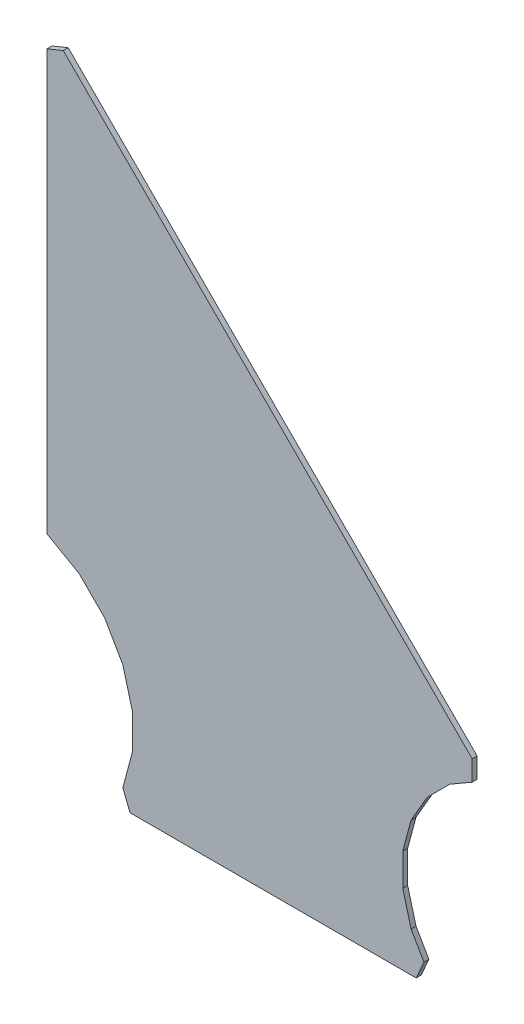
ISO-10303-21;
HEADER;
FILE_DESCRIPTION(('STEP AP214'),'2;1');
FILE_NAME('part.step','',(''),(''),'','','');
FILE_SCHEMA(('AUTOMOTIVE_DESIGN { 1 0 10303 214 1 1 1 1 }'));
ENDSEC;
DATA;
#1=APPLICATION_CONTEXT('core data for automotive mechanical design processes');
#2=APPLICATION_PROTOCOL_DEFINITION('international standard','automotive_design',2000,#1);
#3=PRODUCT_CONTEXT('',#1,'mechanical');
#4=PRODUCT('Part','Part','',(#3));
#5=PRODUCT_RELATED_PRODUCT_CATEGORY('part','',(#4));
#6=PRODUCT_DEFINITION_FORMATION('','',#4);
#7=PRODUCT_DEFINITION_CONTEXT('part definition',#1,'design');
#8=PRODUCT_DEFINITION('design','',#6,#7);
#9=PRODUCT_DEFINITION_SHAPE('','',#8);
#10=(LENGTH_UNIT() NAMED_UNIT(*) SI_UNIT(.MILLI.,.METRE.));
#11=(NAMED_UNIT(*) PLANE_ANGLE_UNIT() SI_UNIT($,.RADIAN.));
#12=(NAMED_UNIT(*) SI_UNIT($,.STERADIAN.) SOLID_ANGLE_UNIT());
#13=UNCERTAINTY_MEASURE_WITH_UNIT(LENGTH_MEASURE(1.E-05),#10,'distance_accuracy_value','');
#14=(GEOMETRIC_REPRESENTATION_CONTEXT(3) GLOBAL_UNCERTAINTY_ASSIGNED_CONTEXT((#13)) GLOBAL_UNIT_ASSIGNED_CONTEXT((#10,
#11,#12)) REPRESENTATION_CONTEXT('',''));
#15=CARTESIAN_POINT('',(0.,0.,0.));
#16=DIRECTION('',(0.,0.,1.));
#17=DIRECTION('',(1.,0.,0.));
#18=AXIS2_PLACEMENT_3D('',#15,#16,#17);
#19=CARTESIAN_POINT('',(89.3880004882813,96.5800018310547,0.));
#20=DIRECTION('',(0.38351701467332,-0.923533810672931,0.));
#21=DIRECTION('',(-0.923533810672931,-0.38351701467332,0.));
#22=AXIS2_PLACEMENT_3D('',#19,#20,#21);
#23=PLANE('',#22);
#24=DIRECTION('',(-0.923533810672931,-0.38351701467332,0.));
#25=VECTOR('',#24,1.);
#26=CARTESIAN_POINT('',(89.3880004882812,96.5800018310547,0.03556));
#27=LINE('',#26,#25);
#28=CARTESIAN_POINT('',(89.3880004882812,96.5800018310547,0.03556));
#29=VERTEX_POINT('',#28);
#30=CARTESIAN_POINT('',(89.2699966430664,96.5309982299805,0.03556));
#31=VERTEX_POINT('',#30);
#32=EDGE_CURVE('E11',#29,#31,#27,.T.);
#33=ORIENTED_EDGE('',*,*,#32,.F.);
#34=DIRECTION('',(0.,0.,1.));
#35=VECTOR('',#34,1.);
#36=CARTESIAN_POINT('',(89.3880004882812,96.5800018310547,0.));
#37=LINE('',#36,#35);
#38=CARTESIAN_POINT('',(89.3880004882812,96.5800018310547,0.));
#39=VERTEX_POINT('',#38);
#40=EDGE_CURVE('E24',#39,#29,#37,.T.);
#41=ORIENTED_EDGE('',*,*,#40,.F.);
#42=DIRECTION('',(-0.923533810672931,-0.38351701467332,0.));
#43=VECTOR('',#42,1.);
#44=CARTESIAN_POINT('',(89.3880004882812,96.5800018310547,0.));
#45=LINE('',#44,#43);
#46=CARTESIAN_POINT('',(89.2699966430664,96.5309982299805,0.));
#47=VERTEX_POINT('',#46);
#48=EDGE_CURVE('E172',#39,#47,#45,.T.);
#49=ORIENTED_EDGE('',*,*,#48,.T.);
#50=DIRECTION('',(0.,0.,1.));
#51=VECTOR('',#50,1.);
#52=CARTESIAN_POINT('',(89.2699966430664,96.5309982299805,0.));
#53=LINE('',#52,#51);
#54=EDGE_CURVE('E37',#47,#31,#53,.T.);
#55=ORIENTED_EDGE('',*,*,#54,.T.);
#56=EDGE_LOOP('',(#33,#41,#49,#55));
#57=FACE_BOUND('',#56,.T.);
#58=ADVANCED_FACE('F17',(#57),#23,.F.);
#59=CARTESIAN_POINT('',(89.2699966430664,96.5309982299805,0.));
#60=DIRECTION('',(1.,0.,0.));
#61=DIRECTION('',(0.,-1.,0.));
#62=AXIS2_PLACEMENT_3D('',#59,#60,#61);
#63=PLANE('',#62);
#64=DIRECTION('',(0.,-1.,0.));
#65=VECTOR('',#64,1.);
#66=CARTESIAN_POINT('',(89.2699966430664,96.5309982299805,0.03556));
#67=LINE('',#66,#65);
#68=CARTESIAN_POINT('',(89.2699966430664,93.5019989013672,0.03556));
#69=VERTEX_POINT('',#68);
#70=EDGE_CURVE('E308',#31,#69,#67,.T.);
#71=ORIENTED_EDGE('',*,*,#70,.F.);
#72=ORIENTED_EDGE('',*,*,#54,.F.);
#73=DIRECTION('',(0.,-1.,0.));
#74=VECTOR('',#73,1.);
#75=CARTESIAN_POINT('',(89.2699966430664,96.5309982299805,0.));
#76=LINE('',#75,#74);
#77=CARTESIAN_POINT('',(89.2699966430664,93.5019989013672,0.));
#78=VERTEX_POINT('',#77);
#79=EDGE_CURVE('E305',#47,#78,#76,.T.);
#80=ORIENTED_EDGE('',*,*,#79,.T.);
#81=DIRECTION('',(0.,0.,1.));
#82=VECTOR('',#81,1.);
#83=CARTESIAN_POINT('',(89.2699966430664,93.5019989013672,0.));
#84=LINE('',#83,#82);
#85=EDGE_CURVE('E303',#78,#69,#84,.T.);
#86=ORIENTED_EDGE('',*,*,#85,.T.);
#87=EDGE_LOOP('',(#71,#72,#80,#86));
#88=FACE_BOUND('',#87,.T.);
#89=ADVANCED_FACE('F316',(#88),#63,.F.);
#90=CARTESIAN_POINT('',(89.2699966430664,93.5019989013672,0.));
#91=DIRECTION('',(0.494509729957547,0.869172092843134,0.));
#92=DIRECTION('',(0.869172092843134,-0.494509729957547,0.));
#93=AXIS2_PLACEMENT_3D('',#90,#91,#92);
#94=PLANE('',#93);
#95=DIRECTION('',(0.869172092843134,-0.494509729957547,0.));
#96=VECTOR('',#95,1.);
#97=CARTESIAN_POINT('',(89.2699966430664,93.5019989013672,0.03556));
#98=LINE('',#97,#96);
#99=CARTESIAN_POINT('',(89.5019989013672,93.370002746582,0.03556));
#100=VERTEX_POINT('',#99);
#101=EDGE_CURVE('E300',#69,#100,#98,.T.);
#102=ORIENTED_EDGE('',*,*,#101,.F.);
#103=ORIENTED_EDGE('',*,*,#85,.F.);
#104=DIRECTION('',(0.869172092843134,-0.494509729957547,0.));
#105=VECTOR('',#104,1.);
#106=CARTESIAN_POINT('',(89.2699966430664,93.5019989013672,0.));
#107=LINE('',#106,#105);
#108=CARTESIAN_POINT('',(89.5019989013672,93.370002746582,0.));
#109=VERTEX_POINT('',#108);
#110=EDGE_CURVE('E297',#78,#109,#107,.T.);
#111=ORIENTED_EDGE('',*,*,#110,.T.);
#112=DIRECTION('',(0.,0.,1.));
#113=VECTOR('',#112,1.);
#114=CARTESIAN_POINT('',(89.5019989013672,93.370002746582,0.));
#115=LINE('',#114,#113);
#116=EDGE_CURVE('E295',#109,#100,#115,.T.);
#117=ORIENTED_EDGE('',*,*,#116,.T.);
#118=EDGE_LOOP('',(#102,#103,#111,#117));
#119=FACE_BOUND('',#118,.T.);
#120=ADVANCED_FACE('F322',(#119),#94,.F.);
#121=CARTESIAN_POINT('',(89.5019989013672,93.370002746582,0.));
#122=DIRECTION('',(0.707121361459365,0.707092200613084,0.));
#123=DIRECTION('',(0.707092200613084,-0.707121361459365,0.));
#124=AXIS2_PLACEMENT_3D('',#121,#122,#123);
#125=PLANE('',#124);
#126=DIRECTION('',(0.707092200613084,-0.707121361459365,0.));
#127=VECTOR('',#126,1.);
#128=CARTESIAN_POINT('',(89.5019989013672,93.370002746582,0.03556));
#129=LINE('',#128,#127);
#130=CARTESIAN_POINT('',(89.6869964599609,93.1849975585938,0.03556));
#131=VERTEX_POINT('',#130);
#132=EDGE_CURVE('E292',#100,#131,#129,.T.);
#133=ORIENTED_EDGE('',*,*,#132,.F.);
#134=ORIENTED_EDGE('',*,*,#116,.F.);
#135=DIRECTION('',(0.707092200613084,-0.707121361459365,0.));
#136=VECTOR('',#135,1.);
#137=CARTESIAN_POINT('',(89.5019989013672,93.370002746582,0.));
#138=LINE('',#137,#136);
#139=CARTESIAN_POINT('',(89.6869964599609,93.1849975585938,0.));
#140=VERTEX_POINT('',#139);
#141=EDGE_CURVE('E289',#109,#140,#138,.T.);
#142=ORIENTED_EDGE('',*,*,#141,.T.);
#143=DIRECTION('',(0.,0.,1.));
#144=VECTOR('',#143,1.);
#145=CARTESIAN_POINT('',(89.6869964599609,93.1849975585938,0.));
#146=LINE('',#145,#144);
#147=EDGE_CURVE('E287',#140,#131,#146,.T.);
#148=ORIENTED_EDGE('',*,*,#147,.T.);
#149=EDGE_LOOP('',(#133,#134,#142,#148));
#150=FACE_BOUND('',#149,.T.);
#151=ADVANCED_FACE('F324',(#150),#125,.F.);
#152=CARTESIAN_POINT('',(89.6869964599609,93.1849975585938,0.));
#153=DIRECTION('',(0.866112397687365,0.4998492918593,0.));
#154=DIRECTION('',(0.4998492918593,-0.866112397687365,0.));
#155=AXIS2_PLACEMENT_3D('',#152,#153,#154);
#156=PLANE('',#155);
#157=DIRECTION('',(0.4998492918593,-0.866112397687365,0.));
#158=VECTOR('',#157,1.);
#159=CARTESIAN_POINT('',(89.6869964599609,93.1849975585938,0.03556));
#160=LINE('',#159,#158);
#161=CARTESIAN_POINT('',(89.818000793457,92.9580001831055,0.03556));
#162=VERTEX_POINT('',#161);
#163=EDGE_CURVE('E284',#131,#162,#160,.T.);
#164=ORIENTED_EDGE('',*,*,#163,.F.);
#165=ORIENTED_EDGE('',*,*,#147,.F.);
#166=DIRECTION('',(0.4998492918593,-0.866112397687365,0.));
#167=VECTOR('',#166,1.);
#168=CARTESIAN_POINT('',(89.6869964599609,93.1849975585938,0.));
#169=LINE('',#168,#167);
#170=CARTESIAN_POINT('',(89.818000793457,92.9580001831055,0.));
#171=VERTEX_POINT('',#170);
#172=EDGE_CURVE('E281',#140,#171,#169,.T.);
#173=ORIENTED_EDGE('',*,*,#172,.T.);
#174=DIRECTION('',(0.,0.,1.));
#175=VECTOR('',#174,1.);
#176=CARTESIAN_POINT('',(89.818000793457,92.9580001831055,0.));
#177=LINE('',#176,#175);
#178=EDGE_CURVE('E279',#171,#162,#177,.T.);
#179=ORIENTED_EDGE('',*,*,#178,.T.);
#180=EDGE_LOOP('',(#164,#165,#173,#179));
#181=FACE_BOUND('',#180,.T.);
#182=ADVANCED_FACE('F329',(#181),#156,.F.);
#183=CARTESIAN_POINT('',(89.818000793457,92.9580001831055,0.));
#184=DIRECTION('',(0.965725052450136,0.259567184116524,0.));
#185=DIRECTION('',(0.259567184116524,-0.965725052450136,0.));
#186=AXIS2_PLACEMENT_3D('',#183,#184,#185);
#187=PLANE('',#186);
#188=DIRECTION('',(0.259567184116524,-0.965725052450136,0.));
#189=VECTOR('',#188,1.);
#190=CARTESIAN_POINT('',(89.818000793457,92.9580001831055,0.03556));
#191=LINE('',#190,#189);
#192=CARTESIAN_POINT('',(89.8860015869141,92.7050018310547,0.03556));
#193=VERTEX_POINT('',#192);
#194=EDGE_CURVE('E276',#162,#193,#191,.T.);
#195=ORIENTED_EDGE('',*,*,#194,.F.);
#196=ORIENTED_EDGE('',*,*,#178,.F.);
#197=DIRECTION('',(0.259567184116524,-0.965725052450136,0.));
#198=VECTOR('',#197,1.);
#199=CARTESIAN_POINT('',(89.818000793457,92.9580001831055,0.));
#200=LINE('',#199,#198);
#201=CARTESIAN_POINT('',(89.8860015869141,92.7050018310547,0.));
#202=VERTEX_POINT('',#201);
#203=EDGE_CURVE('E273',#171,#202,#200,.T.);
#204=ORIENTED_EDGE('',*,*,#203,.T.);
#205=DIRECTION('',(0.,0.,1.));
#206=VECTOR('',#205,1.);
#207=CARTESIAN_POINT('',(89.8860015869141,92.7050018310547,0.));
#208=LINE('',#207,#206);
#209=EDGE_CURVE('E271',#202,#193,#208,.T.);
#210=ORIENTED_EDGE('',*,*,#209,.T.);
#211=EDGE_LOOP('',(#195,#196,#204,#210));
#212=FACE_BOUND('',#211,.T.);
#213=ADVANCED_FACE('F332',(#212),#187,.F.);
#214=CARTESIAN_POINT('',(89.8860015869141,92.7050018310547,0.));
#215=DIRECTION('',(1.,0.,0.));
#216=DIRECTION('',(0.,-1.,0.));
#217=AXIS2_PLACEMENT_3D('',#214,#215,#216);
#218=PLANE('',#217);
#219=DIRECTION('',(0.,-1.,0.));
#220=VECTOR('',#219,1.);
#221=CARTESIAN_POINT('',(89.8860015869141,92.7050018310547,0.03556));
#222=LINE('',#221,#220);
#223=CARTESIAN_POINT('',(89.8860015869141,92.443000793457,0.03556));
#224=VERTEX_POINT('',#223);
#225=EDGE_CURVE('E268',#193,#224,#222,.T.);
#226=ORIENTED_EDGE('',*,*,#225,.F.);
#227=ORIENTED_EDGE('',*,*,#209,.F.);
#228=DIRECTION('',(0.,-1.,0.));
#229=VECTOR('',#228,1.);
#230=CARTESIAN_POINT('',(89.8860015869141,92.7050018310547,0.));
#231=LINE('',#230,#229);
#232=CARTESIAN_POINT('',(89.8860015869141,92.443000793457,0.));
#233=VERTEX_POINT('',#232);
#234=EDGE_CURVE('E265',#202,#233,#231,.T.);
#235=ORIENTED_EDGE('',*,*,#234,.T.);
#236=DIRECTION('',(0.,0.,1.));
#237=VECTOR('',#236,1.);
#238=CARTESIAN_POINT('',(89.8860015869141,92.443000793457,0.));
#239=LINE('',#238,#237);
#240=EDGE_CURVE('E263',#233,#224,#239,.T.);
#241=ORIENTED_EDGE('',*,*,#240,.T.);
#242=EDGE_LOOP('',(#226,#227,#235,#241));
#243=FACE_BOUND('',#242,.T.);
#244=ADVANCED_FACE('F337',(#243),#218,.F.);
#245=CARTESIAN_POINT('',(89.8860015869141,92.443000793457,0.));
#246=DIRECTION('',(0.965725052450136,-0.259567184116524,0.));
#247=DIRECTION('',(-0.259567184116524,-0.965725052450136,0.));
#248=AXIS2_PLACEMENT_3D('',#245,#246,#247);
#249=PLANE('',#248);
#250=DIRECTION('',(-0.259567184116524,-0.965725052450136,0.));
#251=VECTOR('',#250,1.);
#252=CARTESIAN_POINT('',(89.8860015869141,92.443000793457,0.03556));
#253=LINE('',#252,#251);
#254=CARTESIAN_POINT('',(89.818000793457,92.1900024414062,0.03556));
#255=VERTEX_POINT('',#254);
#256=EDGE_CURVE('E260',#224,#255,#253,.T.);
#257=ORIENTED_EDGE('',*,*,#256,.F.);
#258=ORIENTED_EDGE('',*,*,#240,.F.);
#259=DIRECTION('',(-0.259567184116524,-0.965725052450136,0.));
#260=VECTOR('',#259,1.);
#261=CARTESIAN_POINT('',(89.8860015869141,92.443000793457,0.));
#262=LINE('',#261,#260);
#263=CARTESIAN_POINT('',(89.818000793457,92.1900024414062,0.));
#264=VERTEX_POINT('',#263);
#265=EDGE_CURVE('E257',#233,#264,#262,.T.);
#266=ORIENTED_EDGE('',*,*,#265,.T.);
#267=DIRECTION('',(0.,0.,1.));
#268=VECTOR('',#267,1.);
#269=CARTESIAN_POINT('',(89.818000793457,92.1900024414062,0.));
#270=LINE('',#269,#268);
#271=EDGE_CURVE('E255',#264,#255,#270,.T.);
#272=ORIENTED_EDGE('',*,*,#271,.T.);
#273=EDGE_LOOP('',(#257,#258,#266,#272));
#274=FACE_BOUND('',#273,.T.);
#275=ADVANCED_FACE('F340',(#274),#249,.F.);
#276=CARTESIAN_POINT('',(89.818000793457,92.1900024414062,0.));
#277=DIRECTION('',(0.929451528868773,0.368944244410317,0.));
#278=DIRECTION('',(0.368944244410317,-0.929451528868773,0.));
#279=AXIS2_PLACEMENT_3D('',#276,#277,#278);
#280=PLANE('',#279);
#281=DIRECTION('',(0.368944244410317,-0.929451528868773,0.));
#282=VECTOR('',#281,1.);
#283=CARTESIAN_POINT('',(89.818000793457,92.1900024414062,0.03556));
#284=LINE('',#283,#282);
#285=CARTESIAN_POINT('',(89.870002746582,92.0589981079102,0.03556));
#286=VERTEX_POINT('',#285);
#287=EDGE_CURVE('E252',#255,#286,#284,.T.);
#288=ORIENTED_EDGE('',*,*,#287,.F.);
#289=ORIENTED_EDGE('',*,*,#271,.F.);
#290=DIRECTION('',(0.368944244410317,-0.929451528868773,0.));
#291=VECTOR('',#290,1.);
#292=CARTESIAN_POINT('',(89.818000793457,92.1900024414062,0.));
#293=LINE('',#292,#291);
#294=CARTESIAN_POINT('',(89.870002746582,92.0589981079102,0.));
#295=VERTEX_POINT('',#294);
#296=EDGE_CURVE('E249',#264,#295,#293,.T.);
#297=ORIENTED_EDGE('',*,*,#296,.T.);
#298=DIRECTION('',(0.,0.,1.));
#299=VECTOR('',#298,1.);
#300=CARTESIAN_POINT('',(89.870002746582,92.0589981079102,0.));
#301=LINE('',#300,#299);
#302=EDGE_CURVE('E247',#295,#286,#301,.T.);
#303=ORIENTED_EDGE('',*,*,#302,.T.);
#304=EDGE_LOOP('',(#288,#289,#297,#303));
#305=FACE_BOUND('',#304,.T.);
#306=ADVANCED_FACE('F345',(#305),#280,.F.);
#307=CARTESIAN_POINT('',(89.870002746582,92.0589981079102,0.));
#308=DIRECTION('',(0.,1.,0.));
#309=DIRECTION('',(1.,0.,0.));
#310=AXIS2_PLACEMENT_3D('',#307,#308,#309);
#311=PLANE('',#310);
#312=DIRECTION('',(1.,0.,0.));
#313=VECTOR('',#312,1.);
#314=CARTESIAN_POINT('',(89.870002746582,92.0589981079102,0.03556));
#315=LINE('',#314,#313);
#316=CARTESIAN_POINT('',(91.9339981079102,92.0589981079102,0.03556));
#317=VERTEX_POINT('',#316);
#318=EDGE_CURVE('E244',#286,#317,#315,.T.);
#319=ORIENTED_EDGE('',*,*,#318,.F.);
#320=ORIENTED_EDGE('',*,*,#302,.F.);
#321=DIRECTION('',(1.,0.,0.));
#322=VECTOR('',#321,1.);
#323=CARTESIAN_POINT('',(89.870002746582,92.0589981079102,0.));
#324=LINE('',#323,#322);
#325=CARTESIAN_POINT('',(91.9339981079102,92.0589981079102,0.));
#326=VERTEX_POINT('',#325);
#327=EDGE_CURVE('E241',#295,#326,#324,.T.);
#328=ORIENTED_EDGE('',*,*,#327,.T.);
#329=DIRECTION('',(0.,0.,1.));
#330=VECTOR('',#329,1.);
#331=CARTESIAN_POINT('',(91.9339981079102,92.0589981079102,0.));
#332=LINE('',#331,#330);
#333=EDGE_CURVE('E239',#326,#317,#332,.T.);
#334=ORIENTED_EDGE('',*,*,#333,.T.);
#335=EDGE_LOOP('',(#319,#320,#328,#334));
#336=FACE_BOUND('',#335,.T.);
#337=ADVANCED_FACE('F348',(#336),#311,.F.);
#338=CARTESIAN_POINT('',(91.9339981079102,92.0589981079102,0.));
#339=DIRECTION('',(-0.914995400425253,0.403464270042134,0.));
#340=DIRECTION('',(0.403464270042134,0.914995400425253,0.));
#341=AXIS2_PLACEMENT_3D('',#338,#339,#340);
#342=PLANE('',#341);
#343=DIRECTION('',(0.403464270042134,0.914995400425253,0.));
#344=VECTOR('',#343,1.);
#345=CARTESIAN_POINT('',(91.9339981079102,92.0589981079102,0.03556));
#346=LINE('',#345,#344);
#347=CARTESIAN_POINT('',(91.9899978637695,92.1859970092774,0.03556));
#348=VERTEX_POINT('',#347);
#349=EDGE_CURVE('E236',#317,#348,#346,.T.);
#350=ORIENTED_EDGE('',*,*,#349,.F.);
#351=ORIENTED_EDGE('',*,*,#333,.F.);
#352=DIRECTION('',(0.403464270042134,0.914995400425253,0.));
#353=VECTOR('',#352,1.);
#354=CARTESIAN_POINT('',(91.9339981079102,92.0589981079102,0.));
#355=LINE('',#354,#353);
#356=CARTESIAN_POINT('',(91.9899978637695,92.1859970092774,0.));
#357=VERTEX_POINT('',#356);
#358=EDGE_CURVE('E233',#326,#357,#355,.T.);
#359=ORIENTED_EDGE('',*,*,#358,.T.);
#360=DIRECTION('',(0.,0.,1.));
#361=VECTOR('',#360,1.);
#362=CARTESIAN_POINT('',(91.9899978637695,92.1859970092774,0.));
#363=LINE('',#362,#361);
#364=EDGE_CURVE('E231',#357,#348,#363,.T.);
#365=ORIENTED_EDGE('',*,*,#364,.T.);
#366=EDGE_LOOP('',(#350,#351,#359,#365));
#367=FACE_BOUND('',#366,.T.);
#368=ADVANCED_FACE('F353',(#367),#342,.F.);
#369=CARTESIAN_POINT('',(91.9899978637695,92.1859970092774,0.));
#370=DIRECTION('',(-0.865933398902126,-0.500159323281904,0.));
#371=DIRECTION('',(-0.500159323281904,0.865933398902126,0.));
#372=AXIS2_PLACEMENT_3D('',#369,#370,#371);
#373=PLANE('',#372);
#374=DIRECTION('',(-0.500159323281904,0.865933398902126,0.));
#375=VECTOR('',#374,1.);
#376=CARTESIAN_POINT('',(91.9899978637695,92.1859970092774,0.03556));
#377=LINE('',#376,#375);
#378=CARTESIAN_POINT('',(91.8970031738281,92.3470001220703,0.03556));
#379=VERTEX_POINT('',#378);
#380=EDGE_CURVE('E228',#348,#379,#377,.T.);
#381=ORIENTED_EDGE('',*,*,#380,.F.);
#382=ORIENTED_EDGE('',*,*,#364,.F.);
#383=DIRECTION('',(-0.500159323281904,0.865933398902126,0.));
#384=VECTOR('',#383,1.);
#385=CARTESIAN_POINT('',(91.9899978637695,92.1859970092774,0.));
#386=LINE('',#385,#384);
#387=CARTESIAN_POINT('',(91.8970031738281,92.3470001220703,0.));
#388=VERTEX_POINT('',#387);
#389=EDGE_CURVE('E225',#357,#388,#386,.T.);
#390=ORIENTED_EDGE('',*,*,#389,.T.);
#391=DIRECTION('',(0.,0.,1.));
#392=VECTOR('',#391,1.);
#393=CARTESIAN_POINT('',(91.8970031738281,92.3470001220703,0.));
#394=LINE('',#393,#392);
#395=EDGE_CURVE('E223',#388,#379,#394,.T.);
#396=ORIENTED_EDGE('',*,*,#395,.T.);
#397=EDGE_LOOP('',(#381,#382,#390,#396));
#398=FACE_BOUND('',#397,.T.);
#399=ADVANCED_FACE('F356',(#398),#373,.F.);
#400=CARTESIAN_POINT('',(91.8970031738281,92.3470001220703,0.));
#401=DIRECTION('',(-0.965942178013449,-0.258758011923562,0.));
#402=DIRECTION('',(-0.258758011923562,0.965942178013449,0.));
#403=AXIS2_PLACEMENT_3D('',#400,#401,#402);
#404=PLANE('',#403);
#405=DIRECTION('',(-0.258758011923562,0.965942178013449,0.));
#406=VECTOR('',#405,1.);
#407=CARTESIAN_POINT('',(91.8970031738281,92.3470001220703,0.03556));
#408=LINE('',#407,#406);
#409=CARTESIAN_POINT('',(91.8369979858398,92.5709991455078,0.03556));
#410=VERTEX_POINT('',#409);
#411=EDGE_CURVE('E220',#379,#410,#408,.T.);
#412=ORIENTED_EDGE('',*,*,#411,.F.);
#413=ORIENTED_EDGE('',*,*,#395,.F.);
#414=DIRECTION('',(-0.258758011923562,0.965942178013449,0.));
#415=VECTOR('',#414,1.);
#416=CARTESIAN_POINT('',(91.8970031738281,92.3470001220703,0.));
#417=LINE('',#416,#415);
#418=CARTESIAN_POINT('',(91.8369979858398,92.5709991455078,0.));
#419=VERTEX_POINT('',#418);
#420=EDGE_CURVE('E217',#388,#419,#417,.T.);
#421=ORIENTED_EDGE('',*,*,#420,.T.);
#422=DIRECTION('',(0.,0.,1.));
#423=VECTOR('',#422,1.);
#424=CARTESIAN_POINT('',(91.8369979858398,92.5709991455078,0.));
#425=LINE('',#424,#423);
#426=EDGE_CURVE('E215',#419,#410,#425,.T.);
#427=ORIENTED_EDGE('',*,*,#426,.T.);
#428=EDGE_LOOP('',(#412,#413,#421,#427));
#429=FACE_BOUND('',#428,.T.);
#430=ADVANCED_FACE('F361',(#429),#404,.F.);
#431=CARTESIAN_POINT('',(91.8369979858398,92.5709991455078,0.));
#432=DIRECTION('',(-1.,0.,0.));
#433=DIRECTION('',(0.,1.,0.));
#434=AXIS2_PLACEMENT_3D('',#431,#432,#433);
#435=PLANE('',#434);
#436=DIRECTION('',(0.,1.,0.));
#437=VECTOR('',#436,1.);
#438=CARTESIAN_POINT('',(91.8369979858398,92.5709991455078,0.03556));
#439=LINE('',#438,#437);
#440=CARTESIAN_POINT('',(91.8369979858398,92.8030014038086,0.03556));
#441=VERTEX_POINT('',#440);
#442=EDGE_CURVE('E212',#410,#441,#439,.T.);
#443=ORIENTED_EDGE('',*,*,#442,.F.);
#444=ORIENTED_EDGE('',*,*,#426,.F.);
#445=DIRECTION('',(0.,1.,0.));
#446=VECTOR('',#445,1.);
#447=CARTESIAN_POINT('',(91.8369979858398,92.5709991455078,0.));
#448=LINE('',#447,#446);
#449=CARTESIAN_POINT('',(91.8369979858398,92.8030014038086,0.));
#450=VERTEX_POINT('',#449);
#451=EDGE_CURVE('E209',#419,#450,#448,.T.);
#452=ORIENTED_EDGE('',*,*,#451,.T.);
#453=DIRECTION('',(0.,0.,1.));
#454=VECTOR('',#453,1.);
#455=CARTESIAN_POINT('',(91.8369979858398,92.8030014038086,0.));
#456=LINE('',#455,#454);
#457=EDGE_CURVE('E207',#450,#441,#456,.T.);
#458=ORIENTED_EDGE('',*,*,#457,.T.);
#459=EDGE_LOOP('',(#443,#444,#452,#458));
#460=FACE_BOUND('',#459,.T.);
#461=ADVANCED_FACE('F364',(#460),#435,.F.);
#462=CARTESIAN_POINT('',(91.8369979858398,92.8030014038086,0.));
#463=DIRECTION('',(-0.965942178013449,0.258758011923562,0.));
#464=DIRECTION('',(0.258758011923562,0.965942178013449,0.));
#465=AXIS2_PLACEMENT_3D('',#462,#463,#464);
#466=PLANE('',#465);
#467=DIRECTION('',(0.258758011923562,0.965942178013449,0.));
#468=VECTOR('',#467,1.);
#469=CARTESIAN_POINT('',(91.8369979858398,92.8030014038086,0.03556));
#470=LINE('',#469,#468);
#471=CARTESIAN_POINT('',(91.8970031738281,93.0270004272461,0.03556));
#472=VERTEX_POINT('',#471);
#473=EDGE_CURVE('E204',#441,#472,#470,.T.);
#474=ORIENTED_EDGE('',*,*,#473,.F.);
#475=ORIENTED_EDGE('',*,*,#457,.F.);
#476=DIRECTION('',(0.258758011923562,0.965942178013449,0.));
#477=VECTOR('',#476,1.);
#478=CARTESIAN_POINT('',(91.8369979858398,92.8030014038086,0.));
#479=LINE('',#478,#477);
#480=CARTESIAN_POINT('',(91.8970031738281,93.0270004272461,0.));
#481=VERTEX_POINT('',#480);
#482=EDGE_CURVE('E201',#450,#481,#479,.T.);
#483=ORIENTED_EDGE('',*,*,#482,.T.);
#484=DIRECTION('',(0.,0.,1.));
#485=VECTOR('',#484,1.);
#486=CARTESIAN_POINT('',(91.8970031738281,93.0270004272461,0.));
#487=LINE('',#486,#485);
#488=EDGE_CURVE('E199',#481,#472,#487,.T.);
#489=ORIENTED_EDGE('',*,*,#488,.T.);
#490=EDGE_LOOP('',(#474,#475,#483,#489));
#491=FACE_BOUND('',#490,.T.);
#492=ADVANCED_FACE('F369',(#491),#466,.F.);
#493=CARTESIAN_POINT('',(91.8970031738281,93.0270004272461,0.));
#494=DIRECTION('',(-0.865032907846042,0.50171512668388,0.));
#495=DIRECTION('',(0.50171512668388,0.865032907846042,0.));
#496=AXIS2_PLACEMENT_3D('',#493,#494,#495);
#497=PLANE('',#496);
#498=DIRECTION('',(0.50171512668388,0.865032907846042,0.));
#499=VECTOR('',#498,1.);
#500=CARTESIAN_POINT('',(91.8970031738281,93.0270004272461,0.03556));
#501=LINE('',#500,#499);
#502=CARTESIAN_POINT('',(92.0130004882812,93.2269973754883,0.03556));
#503=VERTEX_POINT('',#502);
#504=EDGE_CURVE('E196',#472,#503,#501,.T.);
#505=ORIENTED_EDGE('',*,*,#504,.F.);
#506=ORIENTED_EDGE('',*,*,#488,.F.);
#507=DIRECTION('',(0.50171512668388,0.865032907846042,0.));
#508=VECTOR('',#507,1.);
#509=CARTESIAN_POINT('',(91.8970031738281,93.0270004272461,0.));
#510=LINE('',#509,#508);
#511=CARTESIAN_POINT('',(92.0130004882812,93.2269973754883,0.));
#512=VERTEX_POINT('',#511);
#513=EDGE_CURVE('E193',#481,#512,#510,.T.);
#514=ORIENTED_EDGE('',*,*,#513,.T.);
#515=DIRECTION('',(0.,0.,1.));
#516=VECTOR('',#515,1.);
#517=CARTESIAN_POINT('',(92.0130004882812,93.2269973754883,0.));
#518=LINE('',#517,#516);
#519=EDGE_CURVE('E191',#512,#503,#518,.T.);
#520=ORIENTED_EDGE('',*,*,#519,.T.);
#521=EDGE_LOOP('',(#505,#506,#514,#520));
#522=FACE_BOUND('',#521,.T.);
#523=ADVANCED_FACE('F372',(#522),#497,.F.);
#524=CARTESIAN_POINT('',(92.0130004882812,93.2269973754883,0.));
#525=DIRECTION('',(-0.707106781186548,0.707106781186548,0.));
#526=DIRECTION('',(0.707106781186548,0.707106781186548,0.));
#527=AXIS2_PLACEMENT_3D('',#524,#525,#526);
#528=PLANE('',#527);
#529=DIRECTION('',(0.707106781186548,0.707106781186548,0.));
#530=VECTOR('',#529,1.);
#531=CARTESIAN_POINT('',(92.0130004882812,93.2269973754883,0.03556));
#532=LINE('',#531,#530);
#533=CARTESIAN_POINT('',(92.177001953125,93.390998840332,0.03556));
#534=VERTEX_POINT('',#533);
#535=EDGE_CURVE('E188',#503,#534,#532,.T.);
#536=ORIENTED_EDGE('',*,*,#535,.F.);
#537=ORIENTED_EDGE('',*,*,#519,.F.);
#538=DIRECTION('',(0.707106781186548,0.707106781186548,0.));
#539=VECTOR('',#538,1.);
#540=CARTESIAN_POINT('',(92.0130004882812,93.2269973754883,0.));
#541=LINE('',#540,#539);
#542=CARTESIAN_POINT('',(92.177001953125,93.390998840332,0.));
#543=VERTEX_POINT('',#542);
#544=EDGE_CURVE('E185',#512,#543,#541,.T.);
#545=ORIENTED_EDGE('',*,*,#544,.T.);
#546=DIRECTION('',(0.,0.,1.));
#547=VECTOR('',#546,1.);
#548=CARTESIAN_POINT('',(92.177001953125,93.390998840332,0.));
#549=LINE('',#548,#547);
#550=EDGE_CURVE('E183',#543,#534,#549,.T.);
#551=ORIENTED_EDGE('',*,*,#550,.T.);
#552=EDGE_LOOP('',(#536,#537,#545,#551));
#553=FACE_BOUND('',#552,.T.);
#554=ADVANCED_FACE('F377',(#553),#528,.F.);
#555=CARTESIAN_POINT('',(92.177001953125,93.390998840332,0.));
#556=DIRECTION('',(-0.5002078638044,0.865905360295361,0.));
#557=DIRECTION('',(0.865905360295361,0.5002078638044,0.));
#558=AXIS2_PLACEMENT_3D('',#555,#556,#557);
#559=PLANE('',#558);
#560=DIRECTION('',(0.865905360295361,0.5002078638044,0.));
#561=VECTOR('',#560,1.);
#562=CARTESIAN_POINT('',(92.177001953125,93.390998840332,0.03556));
#563=LINE('',#562,#561);
#564=CARTESIAN_POINT('',(92.3379974365234,93.484001159668,0.03556));
#565=VERTEX_POINT('',#564);
#566=EDGE_CURVE('E180',#534,#565,#563,.T.);
#567=ORIENTED_EDGE('',*,*,#566,.F.);
#568=ORIENTED_EDGE('',*,*,#550,.F.);
#569=DIRECTION('',(0.865905360295361,0.5002078638044,0.));
#570=VECTOR('',#569,1.);
#571=CARTESIAN_POINT('',(92.177001953125,93.390998840332,0.));
#572=LINE('',#571,#570);
#573=CARTESIAN_POINT('',(92.3379974365234,93.484001159668,0.));
#574=VERTEX_POINT('',#573);
#575=EDGE_CURVE('E178',#543,#574,#572,.T.);
#576=ORIENTED_EDGE('',*,*,#575,.T.);
#577=DIRECTION('',(0.,0.,1.));
#578=VECTOR('',#577,1.);
#579=CARTESIAN_POINT('',(92.3379974365234,93.484001159668,0.));
#580=LINE('',#579,#578);
#581=EDGE_CURVE('E163',#574,#565,#580,.T.);
#582=ORIENTED_EDGE('',*,*,#581,.T.);
#583=EDGE_LOOP('',(#567,#568,#576,#582));
#584=FACE_BOUND('',#583,.T.);
#585=ADVANCED_FACE('F379',(#584),#559,.F.);
#586=CARTESIAN_POINT('',(92.3379974365234,93.484001159668,0.));
#587=DIRECTION('',(-1.,0.,0.));
#588=DIRECTION('',(0.,1.,0.));
#589=AXIS2_PLACEMENT_3D('',#586,#587,#588);
#590=PLANE('',#589);
#591=DIRECTION('',(0.,1.,0.));
#592=VECTOR('',#591,1.);
#593=CARTESIAN_POINT('',(92.3379974365234,93.484001159668,0.03556));
#594=LINE('',#593,#592);
#595=CARTESIAN_POINT('',(92.3379974365234,93.629997253418,0.03556));
#596=VERTEX_POINT('',#595);
#597=EDGE_CURVE('E167',#565,#596,#594,.T.);
#598=ORIENTED_EDGE('',*,*,#597,.F.);
#599=ORIENTED_EDGE('',*,*,#581,.F.);
#600=DIRECTION('',(0.,1.,0.));
#601=VECTOR('',#600,1.);
#602=CARTESIAN_POINT('',(92.3379974365234,93.484001159668,0.));
#603=LINE('',#602,#601);
#604=CARTESIAN_POINT('',(92.3379974365234,93.629997253418,0.));
#605=VERTEX_POINT('',#604);
#606=EDGE_CURVE('E159',#574,#605,#603,.T.);
#607=ORIENTED_EDGE('',*,*,#606,.T.);
#608=DIRECTION('',(0.,0.,1.));
#609=VECTOR('',#608,1.);
#610=CARTESIAN_POINT('',(92.3379974365234,93.629997253418,0.));
#611=LINE('',#610,#609);
#612=EDGE_CURVE('E149',#605,#596,#611,.T.);
#613=ORIENTED_EDGE('',*,*,#612,.T.);
#614=EDGE_LOOP('',(#598,#599,#607,#613));
#615=FACE_BOUND('',#614,.T.);
#616=ADVANCED_FACE('F162',(#615),#590,.F.);
#617=CARTESIAN_POINT('',(92.3379974365234,93.629997253418,0.));
#618=DIRECTION('',(-0.707107695558027,-0.707105866813886,0.));
#619=DIRECTION('',(-0.707105866813886,0.707107695558027,0.));
#620=AXIS2_PLACEMENT_3D('',#617,#618,#619);
#621=PLANE('',#620);
#622=DIRECTION('',(-0.707105866813886,0.707107695558027,0.));
#623=VECTOR('',#622,1.);
#624=CARTESIAN_POINT('',(92.3379974365234,93.629997253418,0.03556));
#625=LINE('',#624,#623);
#626=EDGE_CURVE('E155',#596,#29,#625,.T.);
#627=ORIENTED_EDGE('',*,*,#626,.F.);
#628=ORIENTED_EDGE('',*,*,#612,.F.);
#629=DIRECTION('',(-0.707105866813886,0.707107695558027,0.));
#630=VECTOR('',#629,1.);
#631=CARTESIAN_POINT('',(92.3379974365234,93.629997253418,0.));
#632=LINE('',#631,#630);
#633=EDGE_CURVE('E153',#605,#39,#632,.T.);
#634=ORIENTED_EDGE('',*,*,#633,.T.);
#635=ORIENTED_EDGE('',*,*,#40,.T.);
#636=EDGE_LOOP('',(#627,#628,#634,#635));
#637=FACE_BOUND('',#636,.T.);
#638=ADVANCED_FACE('F151',(#637),#621,.F.);
#639=CARTESIAN_POINT('',(89.3880004882813,96.5800018310547,0.));
#640=DIRECTION('',(0.,0.,-1.));
#641=DIRECTION('',(-1.,0.,0.));
#642=AXIS2_PLACEMENT_3D('',#639,#640,#641);
#643=PLANE('',#642);
#644=ORIENTED_EDGE('',*,*,#633,.F.);
#645=ORIENTED_EDGE('',*,*,#606,.F.);
#646=ORIENTED_EDGE('',*,*,#575,.F.);
#647=ORIENTED_EDGE('',*,*,#544,.F.);
#648=ORIENTED_EDGE('',*,*,#513,.F.);
#649=ORIENTED_EDGE('',*,*,#482,.F.);
#650=ORIENTED_EDGE('',*,*,#451,.F.);
#651=ORIENTED_EDGE('',*,*,#420,.F.);
#652=ORIENTED_EDGE('',*,*,#389,.F.);
#653=ORIENTED_EDGE('',*,*,#358,.F.);
#654=ORIENTED_EDGE('',*,*,#327,.F.);
#655=ORIENTED_EDGE('',*,*,#296,.F.);
#656=ORIENTED_EDGE('',*,*,#265,.F.);
#657=ORIENTED_EDGE('',*,*,#234,.F.);
#658=ORIENTED_EDGE('',*,*,#203,.F.);
#659=ORIENTED_EDGE('',*,*,#172,.F.);
#660=ORIENTED_EDGE('',*,*,#141,.F.);
#661=ORIENTED_EDGE('',*,*,#110,.F.);
#662=ORIENTED_EDGE('',*,*,#79,.F.);
#663=ORIENTED_EDGE('',*,*,#48,.F.);
#664=EDGE_LOOP('',(#644,#645,#646,#647,#648,#649,#650,#651,#652,#653,#654,#655,#656,#657,#658,
#659,#660,#661,#662,#663));
#665=FACE_BOUND('',#664,.T.);
#666=ADVANCED_FACE('F170',(#665),#643,.T.);
#667=CARTESIAN_POINT('',(89.3880004882813,96.5800018310547,0.03556));
#668=DIRECTION('',(0.,0.,-1.));
#669=DIRECTION('',(-1.,0.,0.));
#670=AXIS2_PLACEMENT_3D('',#667,#668,#669);
#671=PLANE('',#670);
#672=ORIENTED_EDGE('',*,*,#32,.T.);
#673=ORIENTED_EDGE('',*,*,#70,.T.);
#674=ORIENTED_EDGE('',*,*,#101,.T.);
#675=ORIENTED_EDGE('',*,*,#132,.T.);
#676=ORIENTED_EDGE('',*,*,#163,.T.);
#677=ORIENTED_EDGE('',*,*,#194,.T.);
#678=ORIENTED_EDGE('',*,*,#225,.T.);
#679=ORIENTED_EDGE('',*,*,#256,.T.);
#680=ORIENTED_EDGE('',*,*,#287,.T.);
#681=ORIENTED_EDGE('',*,*,#318,.T.);
#682=ORIENTED_EDGE('',*,*,#349,.T.);
#683=ORIENTED_EDGE('',*,*,#380,.T.);
#684=ORIENTED_EDGE('',*,*,#411,.T.);
#685=ORIENTED_EDGE('',*,*,#442,.T.);
#686=ORIENTED_EDGE('',*,*,#473,.T.);
#687=ORIENTED_EDGE('',*,*,#504,.T.);
#688=ORIENTED_EDGE('',*,*,#535,.T.);
#689=ORIENTED_EDGE('',*,*,#566,.T.);
#690=ORIENTED_EDGE('',*,*,#597,.T.);
#691=ORIENTED_EDGE('',*,*,#626,.T.);
#692=EDGE_LOOP('',(#672,#673,#674,#675,#676,#677,#678,#679,#680,#681,#682,#683,#684,#685,#686,
#687,#688,#689,#690,#691));
#693=FACE_BOUND('',#692,.T.);
#694=ADVANCED_FACE('F319',(#693),#671,.F.);
#695=CLOSED_SHELL('',(#58,#89,#120,#151,#182,#213,#244,#275,#306,#337,#368,#399,#430,#461,#492,
#523,#554,#585,#616,#638,#666,#694));
#696=MANIFOLD_SOLID_BREP('B1',#695);
#697=ADVANCED_BREP_SHAPE_REPRESENTATION('',(#18,#696),#14);
#698=SHAPE_DEFINITION_REPRESENTATION(#9,#697);
ENDSEC;
END-ISO-10303-21;
